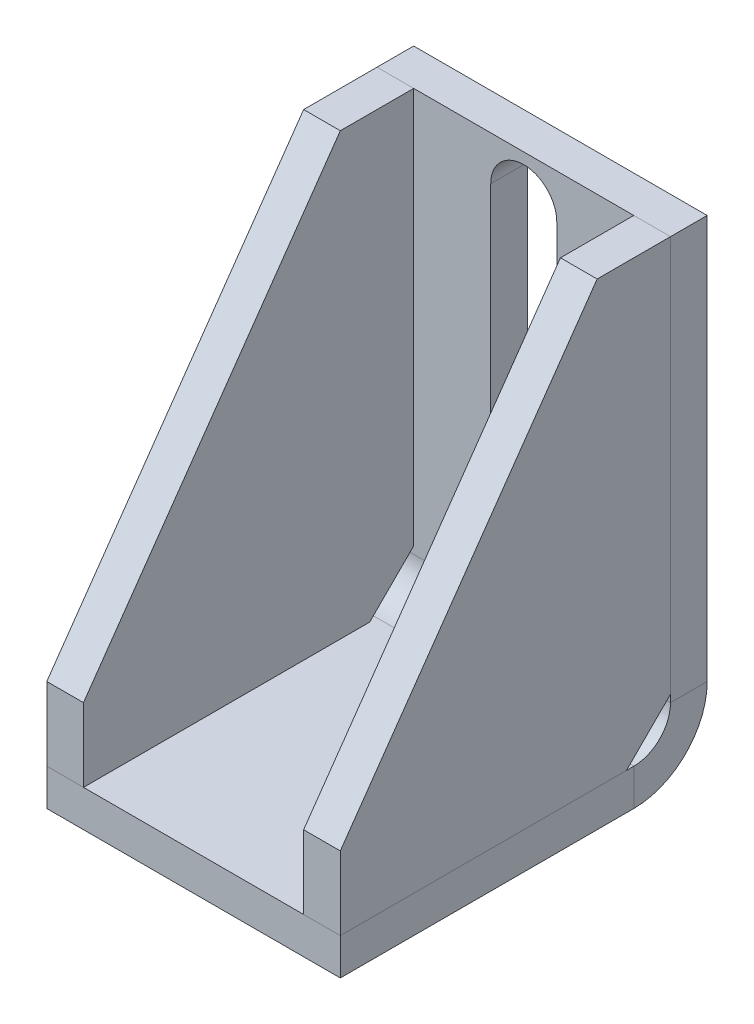
ISO-10303-21;
HEADER;
FILE_DESCRIPTION(('STEP AP214'),'2;1');
FILE_NAME('part.step','',(''),(''),'','','');
FILE_SCHEMA(('AUTOMOTIVE_DESIGN { 1 0 10303 214 1 1 1 1 }'));
ENDSEC;
DATA;
#1=APPLICATION_CONTEXT('core data for automotive mechanical design processes');
#2=APPLICATION_PROTOCOL_DEFINITION('international standard','automotive_design',2000,#1);
#3=PRODUCT_CONTEXT('',#1,'mechanical');
#4=PRODUCT('Part','Part','',(#3));
#5=PRODUCT_RELATED_PRODUCT_CATEGORY('part','',(#4));
#6=PRODUCT_DEFINITION_FORMATION('','',#4);
#7=PRODUCT_DEFINITION_CONTEXT('part definition',#1,'design');
#8=PRODUCT_DEFINITION('design','',#6,#7);
#9=PRODUCT_DEFINITION_SHAPE('','',#8);
#10=(LENGTH_UNIT() NAMED_UNIT(*) SI_UNIT(.MILLI.,.METRE.));
#11=(NAMED_UNIT(*) PLANE_ANGLE_UNIT() SI_UNIT($,.RADIAN.));
#12=(NAMED_UNIT(*) SI_UNIT($,.STERADIAN.) SOLID_ANGLE_UNIT());
#13=UNCERTAINTY_MEASURE_WITH_UNIT(LENGTH_MEASURE(1.E-05),#10,'distance_accuracy_value','');
#14=(GEOMETRIC_REPRESENTATION_CONTEXT(3) GLOBAL_UNCERTAINTY_ASSIGNED_CONTEXT((#13)) GLOBAL_UNIT_ASSIGNED_CONTEXT((#10,
#11,#12)) REPRESENTATION_CONTEXT('',''));
#15=CARTESIAN_POINT('',(0.,0.,0.));
#16=DIRECTION('',(0.,0.,1.));
#17=DIRECTION('',(1.,0.,0.));
#18=AXIS2_PLACEMENT_3D('',#15,#16,#17);
#19=CARTESIAN_POINT('',(15.,20.,10.));
#20=DIRECTION('',(0.,1.,0.));
#21=DIRECTION('',(0.,0.,1.));
#22=AXIS2_PLACEMENT_3D('',#19,#20,#21);
#23=PLANE('',#22);
#24=DIRECTION('',(0.,0.,1.));
#25=VECTOR('',#24,1.);
#26=CARTESIAN_POINT('',(20.,20.,10.));
#27=LINE('',#26,#25);
#28=CARTESIAN_POINT('',(20.,20.,0.));
#29=VERTEX_POINT('',#28);
#30=CARTESIAN_POINT('',(20.,20.,10.));
#31=VERTEX_POINT('',#30);
#32=EDGE_CURVE('E245',#29,#31,#27,.T.);
#33=ORIENTED_EDGE('',*,*,#32,.F.);
#34=DIRECTION('',(1.,0.,0.));
#35=VECTOR('',#34,1.);
#36=CARTESIAN_POINT('',(15.,20.,0.));
#37=LINE('',#36,#35);
#38=CARTESIAN_POINT('',(15.,20.,0.));
#39=VERTEX_POINT('',#38);
#40=EDGE_CURVE('E15',#39,#29,#37,.T.);
#41=ORIENTED_EDGE('',*,*,#40,.F.);
#42=DIRECTION('',(0.,0.,1.));
#43=VECTOR('',#42,1.);
#44=CARTESIAN_POINT('',(15.,20.,10.));
#45=LINE('',#44,#43);
#46=CARTESIAN_POINT('',(15.,20.,10.));
#47=VERTEX_POINT('',#46);
#48=EDGE_CURVE('E265',#39,#47,#45,.T.);
#49=ORIENTED_EDGE('',*,*,#48,.T.);
#50=DIRECTION('',(1.,0.,0.));
#51=VECTOR('',#50,1.);
#52=CARTESIAN_POINT('',(15.,20.,10.));
#53=LINE('',#52,#51);
#54=EDGE_CURVE('E156',#47,#31,#53,.T.);
#55=ORIENTED_EDGE('',*,*,#54,.T.);
#56=EDGE_LOOP('',(#33,#41,#49,#55));
#57=FACE_BOUND('',#56,.T.);
#58=ADVANCED_FACE('F153',(#57),#23,.T.);
#59=CARTESIAN_POINT('',(15.,20.,0.));
#60=DIRECTION('',(0.,0.,-1.));
#61=DIRECTION('',(0.,1.,0.));
#62=AXIS2_PLACEMENT_3D('',#59,#60,#61);
#63=PLANE('',#62);
#64=DIRECTION('',(0.,1.,0.));
#65=VECTOR('',#64,1.);
#66=CARTESIAN_POINT('',(20.,20.,0.));
#67=LINE('',#66,#65);
#68=CARTESIAN_POINT('',(20.,-34.0000000000002,0.));
#69=VERTEX_POINT('',#68);
#70=EDGE_CURVE('E262',#69,#29,#67,.T.);
#71=ORIENTED_EDGE('',*,*,#70,.F.);
#72=DIRECTION('',(1.,0.,0.));
#73=VECTOR('',#72,1.);
#74=CARTESIAN_POINT('',(15.,-34.0000000000002,0.));
#75=LINE('',#74,#73);
#76=CARTESIAN_POINT('',(15.,-34.0000000000002,0.));
#77=VERTEX_POINT('',#76);
#78=EDGE_CURVE('E163',#77,#69,#75,.T.);
#79=ORIENTED_EDGE('',*,*,#78,.F.);
#80=DIRECTION('',(0.,1.,0.));
#81=VECTOR('',#80,1.);
#82=CARTESIAN_POINT('',(15.,20.,0.));
#83=LINE('',#82,#81);
#84=EDGE_CURVE('E230',#77,#39,#83,.T.);
#85=ORIENTED_EDGE('',*,*,#84,.T.);
#86=ORIENTED_EDGE('',*,*,#40,.T.);
#87=EDGE_LOOP('',(#71,#79,#85,#86));
#88=FACE_BOUND('',#87,.T.);
#89=ADVANCED_FACE('F279',(#88),#63,.T.);
#90=CARTESIAN_POINT('',(15.,-34.0000000000002,0.));
#91=DIRECTION('',(0.,-0.707106781186548,-0.707106781186547));
#92=DIRECTION('',(0.,0.707106781186547,-0.707106781186548));
#93=AXIS2_PLACEMENT_3D('',#90,#91,#92);
#94=PLANE('',#93);
#95=DIRECTION('',(0.,0.707106781186547,-0.707106781186548));
#96=VECTOR('',#95,1.);
#97=CARTESIAN_POINT('',(20.,-34.0000000000002,0.));
#98=LINE('',#97,#96);
#99=CARTESIAN_POINT('',(20.,-40.0000000000001,5.99999999999999));
#100=VERTEX_POINT('',#99);
#101=EDGE_CURVE('E216',#100,#69,#98,.T.);
#102=ORIENTED_EDGE('',*,*,#101,.F.);
#103=DIRECTION('',(1.,0.,0.));
#104=VECTOR('',#103,1.);
#105=CARTESIAN_POINT('',(15.,-40.0000000000001,5.99999999999999));
#106=LINE('',#105,#104);
#107=CARTESIAN_POINT('',(15.,-40.0000000000001,5.99999999999999));
#108=VERTEX_POINT('',#107);
#109=EDGE_CURVE('E211',#108,#100,#106,.T.);
#110=ORIENTED_EDGE('',*,*,#109,.F.);
#111=DIRECTION('',(0.,0.707106781186547,-0.707106781186548));
#112=VECTOR('',#111,1.);
#113=CARTESIAN_POINT('',(15.,-34.0000000000002,0.));
#114=LINE('',#113,#112);
#115=EDGE_CURVE('E214',#108,#77,#114,.T.);
#116=ORIENTED_EDGE('',*,*,#115,.T.);
#117=ORIENTED_EDGE('',*,*,#78,.T.);
#118=EDGE_LOOP('',(#102,#110,#116,#117));
#119=FACE_BOUND('',#118,.T.);
#120=ADVANCED_FACE('F213',(#119),#94,.T.);
#121=CARTESIAN_POINT('',(15.,-40.0000000000001,5.99999999999999));
#122=DIRECTION('',(0.,-1.,0.));
#123=DIRECTION('',(0.,0.,-1.));
#124=AXIS2_PLACEMENT_3D('',#121,#122,#123);
#125=PLANE('',#124);
#126=DIRECTION('',(0.,0.,-1.));
#127=VECTOR('',#126,1.);
#128=CARTESIAN_POINT('',(20.,-40.0000000000001,5.99999999999999));
#129=LINE('',#128,#127);
#130=CARTESIAN_POINT('',(20.,-40.0000000000002,45.));
#131=VERTEX_POINT('',#130);
#132=EDGE_CURVE('E257',#131,#100,#129,.T.);
#133=ORIENTED_EDGE('',*,*,#132,.F.);
#134=DIRECTION('',(1.,0.,0.));
#135=VECTOR('',#134,1.);
#136=CARTESIAN_POINT('',(15.,-40.0000000000002,45.));
#137=LINE('',#136,#135);
#138=CARTESIAN_POINT('',(15.,-40.0000000000002,45.));
#139=VERTEX_POINT('',#138);
#140=EDGE_CURVE('E222',#139,#131,#137,.T.);
#141=ORIENTED_EDGE('',*,*,#140,.F.);
#142=DIRECTION('',(0.,0.,-1.));
#143=VECTOR('',#142,1.);
#144=CARTESIAN_POINT('',(15.,-40.0000000000001,5.99999999999999));
#145=LINE('',#144,#143);
#146=EDGE_CURVE('E228',#139,#108,#145,.T.);
#147=ORIENTED_EDGE('',*,*,#146,.T.);
#148=ORIENTED_EDGE('',*,*,#109,.T.);
#149=EDGE_LOOP('',(#133,#141,#147,#148));
#150=FACE_BOUND('',#149,.T.);
#151=ADVANCED_FACE('F233',(#150),#125,.T.);
#152=CARTESIAN_POINT('',(15.,-40.0000000000002,45.));
#153=DIRECTION('',(0.,0.,1.));
#154=DIRECTION('',(1.,0.,0.));
#155=AXIS2_PLACEMENT_3D('',#152,#153,#154);
#156=PLANE('',#155);
#157=DIRECTION('',(0.,-1.,0.));
#158=VECTOR('',#157,1.);
#159=CARTESIAN_POINT('',(20.,-40.0000000000002,45.));
#160=LINE('',#159,#158);
#161=CARTESIAN_POINT('',(20.,-30.0000000000001,45.));
#162=VERTEX_POINT('',#161);
#163=EDGE_CURVE('E253',#162,#131,#160,.T.);
#164=ORIENTED_EDGE('',*,*,#163,.F.);
#165=DIRECTION('',(1.,0.,0.));
#166=VECTOR('',#165,1.);
#167=CARTESIAN_POINT('',(15.,-30.0000000000001,45.));
#168=LINE('',#167,#166);
#169=CARTESIAN_POINT('',(15.,-30.0000000000001,45.));
#170=VERTEX_POINT('',#169);
#171=EDGE_CURVE('E270',#170,#162,#168,.T.);
#172=ORIENTED_EDGE('',*,*,#171,.F.);
#173=DIRECTION('',(0.,-1.,0.));
#174=VECTOR('',#173,1.);
#175=CARTESIAN_POINT('',(15.,-40.0000000000002,45.));
#176=LINE('',#175,#174);
#177=EDGE_CURVE('E235',#170,#139,#176,.T.);
#178=ORIENTED_EDGE('',*,*,#177,.T.);
#179=ORIENTED_EDGE('',*,*,#140,.T.);
#180=EDGE_LOOP('',(#164,#172,#178,#179));
#181=FACE_BOUND('',#180,.T.);
#182=ADVANCED_FACE('F292',(#181),#156,.T.);
#183=CARTESIAN_POINT('',(15.,-30.0000000000001,45.));
#184=DIRECTION('',(0.,0.573462344363327,0.819231920519041));
#185=DIRECTION('',(0.,-0.819231920519041,0.573462344363327));
#186=AXIS2_PLACEMENT_3D('',#183,#184,#185);
#187=PLANE('',#186);
#188=DIRECTION('',(0.,-0.819231920519041,0.573462344363327));
#189=VECTOR('',#188,1.);
#190=CARTESIAN_POINT('',(20.,-30.0000000000001,45.));
#191=LINE('',#190,#189);
#192=EDGE_CURVE('E249',#31,#162,#191,.T.);
#193=ORIENTED_EDGE('',*,*,#192,.F.);
#194=ORIENTED_EDGE('',*,*,#54,.F.);
#195=DIRECTION('',(0.,-0.819231920519041,0.573462344363327));
#196=VECTOR('',#195,1.);
#197=CARTESIAN_POINT('',(15.,-30.0000000000001,45.));
#198=LINE('',#197,#196);
#199=EDGE_CURVE('E239',#47,#170,#198,.T.);
#200=ORIENTED_EDGE('',*,*,#199,.T.);
#201=ORIENTED_EDGE('',*,*,#171,.T.);
#202=EDGE_LOOP('',(#193,#194,#200,#201));
#203=FACE_BOUND('',#202,.T.);
#204=ADVANCED_FACE('F276',(#203),#187,.T.);
#205=CARTESIAN_POINT('',(15.,0.,0.));
#206=DIRECTION('',(-1.,0.,0.));
#207=DIRECTION('',(0.,-1.,0.));
#208=AXIS2_PLACEMENT_3D('',#205,#206,#207);
#209=PLANE('',#208);
#210=ORIENTED_EDGE('',*,*,#48,.F.);
#211=ORIENTED_EDGE('',*,*,#84,.F.);
#212=ORIENTED_EDGE('',*,*,#115,.F.);
#213=ORIENTED_EDGE('',*,*,#146,.F.);
#214=ORIENTED_EDGE('',*,*,#177,.F.);
#215=ORIENTED_EDGE('',*,*,#199,.F.);
#216=EDGE_LOOP('',(#210,#211,#212,#213,#214,#215));
#217=FACE_BOUND('',#216,.T.);
#218=ADVANCED_FACE('F226',(#217),#209,.T.);
#219=CARTESIAN_POINT('',(20.,0.,0.));
#220=DIRECTION('',(-1.,0.,0.));
#221=DIRECTION('',(0.,-1.,0.));
#222=AXIS2_PLACEMENT_3D('',#219,#220,#221);
#223=PLANE('',#222);
#224=ORIENTED_EDGE('',*,*,#32,.T.);
#225=ORIENTED_EDGE('',*,*,#192,.T.);
#226=ORIENTED_EDGE('',*,*,#163,.T.);
#227=ORIENTED_EDGE('',*,*,#132,.T.);
#228=ORIENTED_EDGE('',*,*,#101,.T.);
#229=ORIENTED_EDGE('',*,*,#70,.T.);
#230=EDGE_LOOP('',(#224,#225,#226,#227,#228,#229));
#231=FACE_BOUND('',#230,.T.);
#232=ADVANCED_FACE('F278',(#231),#223,.F.);
#233=CLOSED_SHELL('',(#58,#89,#120,#151,#182,#204,#218,#232));
#234=MANIFOLD_SOLID_BREP('B2',#233);
#235=CARTESIAN_POINT('',(-15.,-34.0000000000002,0.));
#236=DIRECTION('',(0.,0.,-1.));
#237=DIRECTION('',(-1.,0.,0.));
#238=AXIS2_PLACEMENT_3D('',#235,#236,#237);
#239=PLANE('',#238);
#240=DIRECTION('',(0.,-1.,0.));
#241=VECTOR('',#240,1.);
#242=CARTESIAN_POINT('',(-20.,-34.0000000000002,0.));
#243=LINE('',#242,#241);
#244=CARTESIAN_POINT('',(-20.,20.,0.));
#245=VERTEX_POINT('',#244);
#246=CARTESIAN_POINT('',(-20.,-34.0000000000002,0.));
#247=VERTEX_POINT('',#246);
#248=EDGE_CURVE('E481',#245,#247,#243,.T.);
#249=ORIENTED_EDGE('',*,*,#248,.F.);
#250=DIRECTION('',(-1.,0.,0.));
#251=VECTOR('',#250,1.);
#252=CARTESIAN_POINT('',(-15.,20.,0.));
#253=LINE('',#252,#251);
#254=CARTESIAN_POINT('',(-15.,20.,0.));
#255=VERTEX_POINT('',#254);
#256=EDGE_CURVE('E151',#255,#245,#253,.T.);
#257=ORIENTED_EDGE('',*,*,#256,.F.);
#258=DIRECTION('',(0.,-1.,0.));
#259=VECTOR('',#258,1.);
#260=CARTESIAN_POINT('',(-15.,-34.0000000000002,0.));
#261=LINE('',#260,#259);
#262=CARTESIAN_POINT('',(-15.,-34.0000000000002,0.));
#263=VERTEX_POINT('',#262);
#264=EDGE_CURVE('E501',#255,#263,#261,.T.);
#265=ORIENTED_EDGE('',*,*,#264,.T.);
#266=DIRECTION('',(-1.,0.,0.));
#267=VECTOR('',#266,1.);
#268=CARTESIAN_POINT('',(-15.,-34.0000000000002,0.));
#269=LINE('',#268,#267);
#270=EDGE_CURVE('E392',#263,#247,#269,.T.);
#271=ORIENTED_EDGE('',*,*,#270,.T.);
#272=EDGE_LOOP('',(#249,#257,#265,#271));
#273=FACE_BOUND('',#272,.T.);
#274=ADVANCED_FACE('F389',(#273),#239,.T.);
#275=CARTESIAN_POINT('',(-15.,20.,0.));
#276=DIRECTION('',(0.,1.,0.));
#277=DIRECTION('',(-1.,0.,0.));
#278=AXIS2_PLACEMENT_3D('',#275,#276,#277);
#279=PLANE('',#278);
#280=DIRECTION('',(0.,0.,-1.));
#281=VECTOR('',#280,1.);
#282=CARTESIAN_POINT('',(-20.,20.,0.));
#283=LINE('',#282,#281);
#284=CARTESIAN_POINT('',(-20.,20.,10.));
#285=VERTEX_POINT('',#284);
#286=EDGE_CURVE('E498',#285,#245,#283,.T.);
#287=ORIENTED_EDGE('',*,*,#286,.F.);
#288=DIRECTION('',(-1.,0.,0.));
#289=VECTOR('',#288,1.);
#290=CARTESIAN_POINT('',(-15.,20.,10.));
#291=LINE('',#290,#289);
#292=CARTESIAN_POINT('',(-15.,20.,10.));
#293=VERTEX_POINT('',#292);
#294=EDGE_CURVE('E399',#293,#285,#291,.T.);
#295=ORIENTED_EDGE('',*,*,#294,.F.);
#296=DIRECTION('',(0.,0.,-1.));
#297=VECTOR('',#296,1.);
#298=CARTESIAN_POINT('',(-15.,20.,0.));
#299=LINE('',#298,#297);
#300=EDGE_CURVE('E466',#293,#255,#299,.T.);
#301=ORIENTED_EDGE('',*,*,#300,.T.);
#302=ORIENTED_EDGE('',*,*,#256,.T.);
#303=EDGE_LOOP('',(#287,#295,#301,#302));
#304=FACE_BOUND('',#303,.T.);
#305=ADVANCED_FACE('F515',(#304),#279,.T.);
#306=CARTESIAN_POINT('',(-15.,20.,10.));
#307=DIRECTION('',(0.,0.573462344363327,0.819231920519041));
#308=DIRECTION('',(0.,-0.819231920519041,0.573462344363327));
#309=AXIS2_PLACEMENT_3D('',#306,#307,#308);
#310=PLANE('',#309);
#311=DIRECTION('',(0.,0.819231920519041,-0.573462344363327));
#312=VECTOR('',#311,1.);
#313=CARTESIAN_POINT('',(-20.,20.,10.));
#314=LINE('',#313,#312);
#315=CARTESIAN_POINT('',(-20.,-30.0000000000002,45.));
#316=VERTEX_POINT('',#315);
#317=EDGE_CURVE('E452',#316,#285,#314,.T.);
#318=ORIENTED_EDGE('',*,*,#317,.F.);
#319=DIRECTION('',(-1.,0.,0.));
#320=VECTOR('',#319,1.);
#321=CARTESIAN_POINT('',(-15.,-30.0000000000002,45.));
#322=LINE('',#321,#320);
#323=CARTESIAN_POINT('',(-15.,-30.0000000000002,45.));
#324=VERTEX_POINT('',#323);
#325=EDGE_CURVE('E447',#324,#316,#322,.T.);
#326=ORIENTED_EDGE('',*,*,#325,.F.);
#327=DIRECTION('',(0.,0.819231920519041,-0.573462344363327));
#328=VECTOR('',#327,1.);
#329=CARTESIAN_POINT('',(-15.,20.,10.));
#330=LINE('',#329,#328);
#331=EDGE_CURVE('E450',#324,#293,#330,.T.);
#332=ORIENTED_EDGE('',*,*,#331,.T.);
#333=ORIENTED_EDGE('',*,*,#294,.T.);
#334=EDGE_LOOP('',(#318,#326,#332,#333));
#335=FACE_BOUND('',#334,.T.);
#336=ADVANCED_FACE('F449',(#335),#310,.T.);
#337=CARTESIAN_POINT('',(-15.,-30.0000000000002,45.));
#338=DIRECTION('',(0.,0.,1.));
#339=DIRECTION('',(1.,0.,0.));
#340=AXIS2_PLACEMENT_3D('',#337,#338,#339);
#341=PLANE('',#340);
#342=DIRECTION('',(0.,1.,0.));
#343=VECTOR('',#342,1.);
#344=CARTESIAN_POINT('',(-20.,-30.0000000000002,45.));
#345=LINE('',#344,#343);
#346=CARTESIAN_POINT('',(-20.,-40.0000000000002,45.));
#347=VERTEX_POINT('',#346);
#348=EDGE_CURVE('E493',#347,#316,#345,.T.);
#349=ORIENTED_EDGE('',*,*,#348,.F.);
#350=DIRECTION('',(-1.,0.,0.));
#351=VECTOR('',#350,1.);
#352=CARTESIAN_POINT('',(-15.,-40.0000000000002,45.));
#353=LINE('',#352,#351);
#354=CARTESIAN_POINT('',(-15.,-40.0000000000002,45.));
#355=VERTEX_POINT('',#354);
#356=EDGE_CURVE('E458',#355,#347,#353,.T.);
#357=ORIENTED_EDGE('',*,*,#356,.F.);
#358=DIRECTION('',(0.,1.,0.));
#359=VECTOR('',#358,1.);
#360=CARTESIAN_POINT('',(-15.,-30.0000000000002,45.));
#361=LINE('',#360,#359);
#362=EDGE_CURVE('E464',#355,#324,#361,.T.);
#363=ORIENTED_EDGE('',*,*,#362,.T.);
#364=ORIENTED_EDGE('',*,*,#325,.T.);
#365=EDGE_LOOP('',(#349,#357,#363,#364));
#366=FACE_BOUND('',#365,.T.);
#367=ADVANCED_FACE('F469',(#366),#341,.T.);
#368=CARTESIAN_POINT('',(-15.,-40.0000000000002,45.));
#369=DIRECTION('',(0.,-1.,0.));
#370=DIRECTION('',(0.,0.,-1.));
#371=AXIS2_PLACEMENT_3D('',#368,#369,#370);
#372=PLANE('',#371);
#373=DIRECTION('',(0.,0.,1.));
#374=VECTOR('',#373,1.);
#375=CARTESIAN_POINT('',(-20.,-40.0000000000002,45.));
#376=LINE('',#375,#374);
#377=CARTESIAN_POINT('',(-20.,-40.0000000000002,6.));
#378=VERTEX_POINT('',#377);
#379=EDGE_CURVE('E489',#378,#347,#376,.T.);
#380=ORIENTED_EDGE('',*,*,#379,.F.);
#381=DIRECTION('',(-1.,0.,0.));
#382=VECTOR('',#381,1.);
#383=CARTESIAN_POINT('',(-15.,-40.0000000000002,6.));
#384=LINE('',#383,#382);
#385=CARTESIAN_POINT('',(-15.,-40.0000000000002,6.));
#386=VERTEX_POINT('',#385);
#387=EDGE_CURVE('E506',#386,#378,#384,.T.);
#388=ORIENTED_EDGE('',*,*,#387,.F.);
#389=DIRECTION('',(0.,0.,1.));
#390=VECTOR('',#389,1.);
#391=CARTESIAN_POINT('',(-15.,-40.0000000000002,45.));
#392=LINE('',#391,#390);
#393=EDGE_CURVE('E471',#386,#355,#392,.T.);
#394=ORIENTED_EDGE('',*,*,#393,.T.);
#395=ORIENTED_EDGE('',*,*,#356,.T.);
#396=EDGE_LOOP('',(#380,#388,#394,#395));
#397=FACE_BOUND('',#396,.T.);
#398=ADVANCED_FACE('F528',(#397),#372,.T.);
#399=CARTESIAN_POINT('',(-15.,-40.0000000000002,6.));
#400=DIRECTION('',(0.,-0.707106781186548,-0.707106781186547));
#401=DIRECTION('',(0.,0.707106781186547,-0.707106781186548));
#402=AXIS2_PLACEMENT_3D('',#399,#400,#401);
#403=PLANE('',#402);
#404=DIRECTION('',(0.,-0.707106781186547,0.707106781186548));
#405=VECTOR('',#404,1.);
#406=CARTESIAN_POINT('',(-20.,-40.0000000000002,6.));
#407=LINE('',#406,#405);
#408=EDGE_CURVE('E485',#247,#378,#407,.T.);
#409=ORIENTED_EDGE('',*,*,#408,.F.);
#410=ORIENTED_EDGE('',*,*,#270,.F.);
#411=DIRECTION('',(0.,-0.707106781186547,0.707106781186548));
#412=VECTOR('',#411,1.);
#413=CARTESIAN_POINT('',(-15.,-40.0000000000002,6.));
#414=LINE('',#413,#412);
#415=EDGE_CURVE('E475',#263,#386,#414,.T.);
#416=ORIENTED_EDGE('',*,*,#415,.T.);
#417=ORIENTED_EDGE('',*,*,#387,.T.);
#418=EDGE_LOOP('',(#409,#410,#416,#417));
#419=FACE_BOUND('',#418,.T.);
#420=ADVANCED_FACE('F512',(#419),#403,.T.);
#421=CARTESIAN_POINT('',(-15.,0.,0.));
#422=DIRECTION('',(1.,0.,0.));
#423=DIRECTION('',(0.,1.,0.));
#424=AXIS2_PLACEMENT_3D('',#421,#422,#423);
#425=PLANE('',#424);
#426=ORIENTED_EDGE('',*,*,#264,.F.);
#427=ORIENTED_EDGE('',*,*,#300,.F.);
#428=ORIENTED_EDGE('',*,*,#331,.F.);
#429=ORIENTED_EDGE('',*,*,#362,.F.);
#430=ORIENTED_EDGE('',*,*,#393,.F.);
#431=ORIENTED_EDGE('',*,*,#415,.F.);
#432=EDGE_LOOP('',(#426,#427,#428,#429,#430,#431));
#433=FACE_BOUND('',#432,.T.);
#434=ADVANCED_FACE('F462',(#433),#425,.T.);
#435=CARTESIAN_POINT('',(-20.,0.,0.));
#436=DIRECTION('',(1.,0.,0.));
#437=DIRECTION('',(0.,1.,0.));
#438=AXIS2_PLACEMENT_3D('',#435,#436,#437);
#439=PLANE('',#438);
#440=ORIENTED_EDGE('',*,*,#248,.T.);
#441=ORIENTED_EDGE('',*,*,#408,.T.);
#442=ORIENTED_EDGE('',*,*,#379,.T.);
#443=ORIENTED_EDGE('',*,*,#348,.T.);
#444=ORIENTED_EDGE('',*,*,#317,.T.);
#445=ORIENTED_EDGE('',*,*,#286,.T.);
#446=EDGE_LOOP('',(#440,#441,#442,#443,#444,#445));
#447=FACE_BOUND('',#446,.T.);
#448=ADVANCED_FACE('F514',(#447),#439,.F.);
#449=CLOSED_SHELL('',(#274,#305,#336,#367,#398,#420,#434,#448));
#450=MANIFOLD_SOLID_BREP('B9',#449);
#451=CARTESIAN_POINT('',(20.,20.,-5.));
#452=DIRECTION('',(1.,0.,0.));
#453=DIRECTION('',(0.,1.,0.));
#454=AXIS2_PLACEMENT_3D('',#451,#452,#453);
#455=PLANE('',#454);
#456=DIRECTION('',(0.,1.,0.));
#457=VECTOR('',#456,1.);
#458=CARTESIAN_POINT('',(20.,20.,0.));
#459=LINE('',#458,#457);
#460=CARTESIAN_POINT('',(20.,-35.,0.));
#461=VERTEX_POINT('',#460);
#462=CARTESIAN_POINT('',(20.,20.,0.));
#463=VERTEX_POINT('',#462);
#464=EDGE_CURVE('E845',#461,#463,#459,.T.);
#465=ORIENTED_EDGE('',*,*,#464,.F.);
#466=DIRECTION('',(0.,0.,-1.));
#467=VECTOR('',#466,1.);
#468=CARTESIAN_POINT('',(20.,-35.,0.));
#469=LINE('',#468,#467);
#470=CARTESIAN_POINT('',(20.,-35.,-5.));
#471=VERTEX_POINT('',#470);
#472=EDGE_CURVE('E807',#461,#471,#469,.T.);
#473=ORIENTED_EDGE('',*,*,#472,.T.);
#474=DIRECTION('',(0.,1.,0.));
#475=VECTOR('',#474,1.);
#476=CARTESIAN_POINT('',(20.,20.,-5.));
#477=LINE('',#476,#475);
#478=CARTESIAN_POINT('',(20.,20.,-5.));
#479=VERTEX_POINT('',#478);
#480=EDGE_CURVE('E834',#471,#479,#477,.T.);
#481=ORIENTED_EDGE('',*,*,#480,.T.);
#482=DIRECTION('',(0.,0.,1.));
#483=VECTOR('',#482,1.);
#484=CARTESIAN_POINT('',(20.,20.,-5.));
#485=LINE('',#484,#483);
#486=EDGE_CURVE('E620',#479,#463,#485,.T.);
#487=ORIENTED_EDGE('',*,*,#486,.T.);
#488=EDGE_LOOP('',(#465,#473,#481,#487));
#489=FACE_BOUND('',#488,.T.);
#490=ADVANCED_FACE('F616',(#489),#455,.T.);
#491=CARTESIAN_POINT('',(0.,0.,-5.));
#492=DIRECTION('',(0.,0.,1.));
#493=DIRECTION('',(1.,0.,0.));
#494=AXIS2_PLACEMENT_3D('',#491,#492,#493);
#495=PLANE('',#494);
#496=DIRECTION('',(0.,-1.,0.));
#497=VECTOR('',#496,1.);
#498=CARTESIAN_POINT('',(-4.5,0.,-5.));
#499=LINE('',#498,#497);
#500=CARTESIAN_POINT('',(-4.5,14.,-5.));
#501=VERTEX_POINT('',#500);
#502=CARTESIAN_POINT('',(-4.5,-13.05,-5.));
#503=VERTEX_POINT('',#502);
#504=EDGE_CURVE('E743',#501,#503,#499,.T.);
#505=ORIENTED_EDGE('',*,*,#504,.T.);
#506=CARTESIAN_POINT('',(0.,-13.05,-5.));
#507=DIRECTION('',(0.,0.,1.));
#508=DIRECTION('',(1.,0.,0.));
#509=AXIS2_PLACEMENT_3D('',#506,#507,#508);
#510=CIRCLE('',#509,4.5);
#511=CARTESIAN_POINT('',(4.5,-13.05,-5.));
#512=VERTEX_POINT('',#511);
#513=EDGE_CURVE('E753',#503,#512,#510,.T.);
#514=ORIENTED_EDGE('',*,*,#513,.T.);
#515=DIRECTION('',(0.,-1.,0.));
#516=VECTOR('',#515,1.);
#517=CARTESIAN_POINT('',(4.5,0.,-5.));
#518=LINE('',#517,#516);
#519=CARTESIAN_POINT('',(4.5,14.,-5.));
#520=VERTEX_POINT('',#519);
#521=EDGE_CURVE('E722',#520,#512,#518,.T.);
#522=ORIENTED_EDGE('',*,*,#521,.F.);
#523=CARTESIAN_POINT('',(0.,14.,-5.));
#524=DIRECTION('',(0.,0.,1.));
#525=DIRECTION('',(1.,0.,0.));
#526=AXIS2_PLACEMENT_3D('',#523,#524,#525);
#527=CIRCLE('',#526,4.5);
#528=EDGE_CURVE('E747',#520,#501,#527,.T.);
#529=ORIENTED_EDGE('',*,*,#528,.T.);
#530=EDGE_LOOP('',(#505,#514,#522,#529));
#531=FACE_BOUND('',#530,.T.);
#532=DIRECTION('',(1.,0.,0.));
#533=VECTOR('',#532,1.);
#534=CARTESIAN_POINT('',(20.,-35.,-5.));
#535=LINE('',#534,#533);
#536=CARTESIAN_POINT('',(-20.,-35.,-5.));
#537=VERTEX_POINT('',#536);
#538=EDGE_CURVE('E799',#471,#537,#535,.F.);
#539=ORIENTED_EDGE('',*,*,#538,.T.);
#540=DIRECTION('',(0.,-1.,0.));
#541=VECTOR('',#540,1.);
#542=CARTESIAN_POINT('',(-20.,20.,-5.));
#543=LINE('',#542,#541);
#544=CARTESIAN_POINT('',(-20.,20.,-5.));
#545=VERTEX_POINT('',#544);
#546=EDGE_CURVE('E830',#545,#537,#543,.T.);
#547=ORIENTED_EDGE('',*,*,#546,.F.);
#548=DIRECTION('',(-1.,0.,0.));
#549=VECTOR('',#548,1.);
#550=CARTESIAN_POINT('',(-20.,20.,-5.));
#551=LINE('',#550,#549);
#552=EDGE_CURVE('E838',#479,#545,#551,.T.);
#553=ORIENTED_EDGE('',*,*,#552,.F.);
#554=ORIENTED_EDGE('',*,*,#480,.F.);
#555=EDGE_LOOP('',(#539,#547,#553,#554));
#556=FACE_BOUND('',#555,.T.);
#557=ADVANCED_FACE('F902',(#531,#556),#495,.F.);
#558=CARTESIAN_POINT('',(0.,0.,0.));
#559=DIRECTION('',(0.,0.,1.));
#560=DIRECTION('',(1.,0.,0.));
#561=AXIS2_PLACEMENT_3D('',#558,#559,#560);
#562=PLANE('',#561);
#563=CARTESIAN_POINT('',(0.,-13.05,0.));
#564=DIRECTION('',(0.,0.,1.));
#565=DIRECTION('',(1.,0.,0.));
#566=AXIS2_PLACEMENT_3D('',#563,#564,#565);
#567=CIRCLE('',#566,4.5);
#568=CARTESIAN_POINT('',(-4.49999999999998,-13.05,0.));
#569=VERTEX_POINT('',#568);
#570=CARTESIAN_POINT('',(4.5,-13.05,0.));
#571=VERTEX_POINT('',#570);
#572=EDGE_CURVE('E705',#569,#571,#567,.T.);
#573=ORIENTED_EDGE('',*,*,#572,.F.);
#574=DIRECTION('',(0.,-1.,0.));
#575=VECTOR('',#574,1.);
#576=CARTESIAN_POINT('',(-4.49999999999998,14.,0.));
#577=LINE('',#576,#575);
#578=CARTESIAN_POINT('',(-4.5,14.,0.));
#579=VERTEX_POINT('',#578);
#580=EDGE_CURVE('E729',#579,#569,#577,.T.);
#581=ORIENTED_EDGE('',*,*,#580,.F.);
#582=CARTESIAN_POINT('',(0.,14.,0.));
#583=DIRECTION('',(0.,0.,1.));
#584=DIRECTION('',(1.,0.,0.));
#585=AXIS2_PLACEMENT_3D('',#582,#583,#584);
#586=CIRCLE('',#585,4.5);
#587=CARTESIAN_POINT('',(4.5,14.,0.));
#588=VERTEX_POINT('',#587);
#589=EDGE_CURVE('E727',#588,#579,#586,.T.);
#590=ORIENTED_EDGE('',*,*,#589,.F.);
#591=DIRECTION('',(0.,-1.,0.));
#592=VECTOR('',#591,1.);
#593=CARTESIAN_POINT('',(4.5,14.,0.));
#594=LINE('',#593,#592);
#595=EDGE_CURVE('E719',#588,#571,#594,.T.);
#596=ORIENTED_EDGE('',*,*,#595,.T.);
#597=EDGE_LOOP('',(#573,#581,#590,#596));
#598=FACE_BOUND('',#597,.T.);
#599=DIRECTION('',(0.,-1.,0.));
#600=VECTOR('',#599,1.);
#601=CARTESIAN_POINT('',(-20.,20.,0.));
#602=LINE('',#601,#600);
#603=CARTESIAN_POINT('',(-20.,20.,0.));
#604=VERTEX_POINT('',#603);
#605=CARTESIAN_POINT('',(-20.,-35.,0.));
#606=VERTEX_POINT('',#605);
#607=EDGE_CURVE('E826',#604,#606,#602,.T.);
#608=ORIENTED_EDGE('',*,*,#607,.T.);
#609=DIRECTION('',(1.,0.,0.));
#610=VECTOR('',#609,1.);
#611=CARTESIAN_POINT('',(20.,-35.,0.));
#612=LINE('',#611,#610);
#613=EDGE_CURVE('E815',#461,#606,#612,.F.);
#614=ORIENTED_EDGE('',*,*,#613,.F.);
#615=ORIENTED_EDGE('',*,*,#464,.T.);
#616=DIRECTION('',(-1.,0.,0.));
#617=VECTOR('',#616,1.);
#618=CARTESIAN_POINT('',(-20.,20.,0.));
#619=LINE('',#618,#617);
#620=EDGE_CURVE('E835',#463,#604,#619,.T.);
#621=ORIENTED_EDGE('',*,*,#620,.T.);
#622=EDGE_LOOP('',(#608,#614,#615,#621));
#623=FACE_BOUND('',#622,.T.);
#624=ADVANCED_FACE('F725',(#598,#623),#562,.T.);
#625=CARTESIAN_POINT('',(-20.,20.,-5.));
#626=DIRECTION('',(-1.,0.,0.));
#627=DIRECTION('',(0.,-1.,0.));
#628=AXIS2_PLACEMENT_3D('',#625,#626,#627);
#629=PLANE('',#628);
#630=DIRECTION('',(0.,0.,-1.));
#631=VECTOR('',#630,1.);
#632=CARTESIAN_POINT('',(-20.,-35.,0.));
#633=LINE('',#632,#631);
#634=EDGE_CURVE('E822',#606,#537,#633,.T.);
#635=ORIENTED_EDGE('',*,*,#634,.F.);
#636=ORIENTED_EDGE('',*,*,#607,.F.);
#637=DIRECTION('',(0.,0.,1.));
#638=VECTOR('',#637,1.);
#639=CARTESIAN_POINT('',(-20.,20.,-5.));
#640=LINE('',#639,#638);
#641=EDGE_CURVE('E387',#545,#604,#640,.T.);
#642=ORIENTED_EDGE('',*,*,#641,.F.);
#643=ORIENTED_EDGE('',*,*,#546,.T.);
#644=EDGE_LOOP('',(#635,#636,#642,#643));
#645=FACE_BOUND('',#644,.T.);
#646=ADVANCED_FACE('F618',(#645),#629,.T.);
#647=CARTESIAN_POINT('',(-20.,20.,-5.));
#648=DIRECTION('',(0.,1.,0.));
#649=DIRECTION('',(-1.,0.,0.));
#650=AXIS2_PLACEMENT_3D('',#647,#648,#649);
#651=PLANE('',#650);
#652=ORIENTED_EDGE('',*,*,#620,.F.);
#653=ORIENTED_EDGE('',*,*,#486,.F.);
#654=ORIENTED_EDGE('',*,*,#552,.T.);
#655=ORIENTED_EDGE('',*,*,#641,.T.);
#656=EDGE_LOOP('',(#652,#653,#654,#655));
#657=FACE_BOUND('',#656,.T.);
#658=ADVANCED_FACE('F857',(#657),#651,.T.);
#659=CARTESIAN_POINT('',(-20.,-35.,5.));
#660=DIRECTION('',(-1.,0.,0.));
#661=DIRECTION('',(0.,0.,1.));
#662=AXIS2_PLACEMENT_3D('',#659,#660,#661);
#663=PLANE('',#662);
#664=DIRECTION('',(0.,1.,0.));
#665=VECTOR('',#664,1.);
#666=CARTESIAN_POINT('',(-20.,-45.,4.99999999999997));
#667=LINE('',#666,#665);
#668=CARTESIAN_POINT('',(-20.,-40.,4.99999999999998));
#669=VERTEX_POINT('',#668);
#670=CARTESIAN_POINT('',(-20.,-45.,4.99999999999997));
#671=VERTEX_POINT('',#670);
#672=EDGE_CURVE('E756',#669,#671,#667,.F.);
#673=ORIENTED_EDGE('',*,*,#672,.F.);
#674=CARTESIAN_POINT('',(-20.,-35.,5.));
#675=DIRECTION('',(1.,0.,0.));
#676=DIRECTION('',(0.,0.,-1.));
#677=AXIS2_PLACEMENT_3D('',#674,#675,#676);
#678=CIRCLE('',#677,5.);
#679=EDGE_CURVE('E811',#606,#669,#678,.F.);
#680=ORIENTED_EDGE('',*,*,#679,.F.);
#681=ORIENTED_EDGE('',*,*,#634,.T.);
#682=CARTESIAN_POINT('',(-20.,-35.,5.));
#683=DIRECTION('',(1.,0.,0.));
#684=DIRECTION('',(0.,0.,-1.));
#685=AXIS2_PLACEMENT_3D('',#682,#683,#684);
#686=CIRCLE('',#685,10.);
#687=EDGE_CURVE('E802',#537,#671,#686,.F.);
#688=ORIENTED_EDGE('',*,*,#687,.T.);
#689=EDGE_LOOP('',(#673,#680,#681,#688));
#690=FACE_BOUND('',#689,.T.);
#691=ADVANCED_FACE('F864',(#690),#663,.T.);
#692=CARTESIAN_POINT('',(20.,-35.,5.));
#693=DIRECTION('',(-1.,0.,0.));
#694=DIRECTION('',(0.,0.,1.));
#695=AXIS2_PLACEMENT_3D('',#692,#693,#694);
#696=PLANE('',#695);
#697=CARTESIAN_POINT('',(20.,-35.,5.));
#698=DIRECTION('',(1.,0.,0.));
#699=DIRECTION('',(0.,0.,-1.));
#700=AXIS2_PLACEMENT_3D('',#697,#698,#699);
#701=CIRCLE('',#700,5.);
#702=CARTESIAN_POINT('',(20.,-40.,4.99999999999998));
#703=VERTEX_POINT('',#702);
#704=EDGE_CURVE('E761',#703,#461,#701,.T.);
#705=ORIENTED_EDGE('',*,*,#704,.F.);
#706=DIRECTION('',(0.,1.,0.));
#707=VECTOR('',#706,1.);
#708=CARTESIAN_POINT('',(20.,-40.,4.99999999999998));
#709=LINE('',#708,#707);
#710=CARTESIAN_POINT('',(20.,-45.,4.99999999999997));
#711=VERTEX_POINT('',#710);
#712=EDGE_CURVE('E789',#703,#711,#709,.F.);
#713=ORIENTED_EDGE('',*,*,#712,.T.);
#714=CARTESIAN_POINT('',(20.,-35.,5.));
#715=DIRECTION('',(1.,0.,0.));
#716=DIRECTION('',(0.,0.,-1.));
#717=AXIS2_PLACEMENT_3D('',#714,#715,#716);
#718=CIRCLE('',#717,10.);
#719=EDGE_CURVE('E803',#711,#471,#718,.T.);
#720=ORIENTED_EDGE('',*,*,#719,.T.);
#721=ORIENTED_EDGE('',*,*,#472,.F.);
#722=EDGE_LOOP('',(#705,#713,#720,#721));
#723=FACE_BOUND('',#722,.T.);
#724=ADVANCED_FACE('F914',(#723),#696,.F.);
#725=CARTESIAN_POINT('',(20.,-35.,5.));
#726=DIRECTION('',(1.,0.,0.));
#727=DIRECTION('',(0.,-1.,0.));
#728=AXIS2_PLACEMENT_3D('',#725,#726,#727);
#729=CYLINDRICAL_SURFACE('',#728,10.);
#730=ORIENTED_EDGE('',*,*,#538,.F.);
#731=ORIENTED_EDGE('',*,*,#719,.F.);
#732=DIRECTION('',(1.,0.,0.));
#733=VECTOR('',#732,1.);
#734=CARTESIAN_POINT('',(-20.,-45.,4.99999999999997));
#735=LINE('',#734,#733);
#736=EDGE_CURVE('E786',#711,#671,#735,.F.);
#737=ORIENTED_EDGE('',*,*,#736,.T.);
#738=ORIENTED_EDGE('',*,*,#687,.F.);
#739=EDGE_LOOP('',(#730,#731,#737,#738));
#740=FACE_BOUND('',#739,.T.);
#741=ADVANCED_FACE('F867',(#740),#729,.T.);
#742=CARTESIAN_POINT('',(20.,-35.,5.));
#743=DIRECTION('',(1.,0.,0.));
#744=DIRECTION('',(0.,-1.,0.));
#745=AXIS2_PLACEMENT_3D('',#742,#743,#744);
#746=CYLINDRICAL_SURFACE('',#745,5.);
#747=ORIENTED_EDGE('',*,*,#613,.T.);
#748=ORIENTED_EDGE('',*,*,#679,.T.);
#749=DIRECTION('',(1.,0.,0.));
#750=VECTOR('',#749,1.);
#751=CARTESIAN_POINT('',(-20.,-40.,4.99999999999998));
#752=LINE('',#751,#750);
#753=EDGE_CURVE('E793',#669,#703,#752,.T.);
#754=ORIENTED_EDGE('',*,*,#753,.T.);
#755=ORIENTED_EDGE('',*,*,#704,.T.);
#756=EDGE_LOOP('',(#747,#748,#754,#755));
#757=FACE_BOUND('',#756,.T.);
#758=ADVANCED_FACE('F888',(#757),#746,.F.);
#759=CARTESIAN_POINT('',(20.,-45.0000000000001,45.));
#760=DIRECTION('',(-1.,0.,0.));
#761=DIRECTION('',(0.,-1.,0.));
#762=AXIS2_PLACEMENT_3D('',#759,#760,#761);
#763=PLANE('',#762);
#764=ORIENTED_EDGE('',*,*,#712,.F.);
#765=DIRECTION('',(0.,0.,-1.));
#766=VECTOR('',#765,1.);
#767=CARTESIAN_POINT('',(20.,-40.0000000000002,45.));
#768=LINE('',#767,#766);
#769=CARTESIAN_POINT('',(20.,-40.0000000000002,45.));
#770=VERTEX_POINT('',#769);
#771=EDGE_CURVE('E783',#703,#770,#768,.F.);
#772=ORIENTED_EDGE('',*,*,#771,.T.);
#773=DIRECTION('',(0.,1.,0.));
#774=VECTOR('',#773,1.);
#775=CARTESIAN_POINT('',(20.,-45.0000000000001,45.));
#776=LINE('',#775,#774);
#777=CARTESIAN_POINT('',(20.,-45.0000000000001,45.));
#778=VERTEX_POINT('',#777);
#779=EDGE_CURVE('E757',#778,#770,#776,.T.);
#780=ORIENTED_EDGE('',*,*,#779,.F.);
#781=DIRECTION('',(0.,0.,1.));
#782=VECTOR('',#781,1.);
#783=CARTESIAN_POINT('',(20.,-45.,-1.70113072580175E-13));
#784=LINE('',#783,#782);
#785=EDGE_CURVE('E773',#711,#778,#784,.T.);
#786=ORIENTED_EDGE('',*,*,#785,.F.);
#787=EDGE_LOOP('',(#764,#772,#780,#786));
#788=FACE_BOUND('',#787,.T.);
#789=ADVANCED_FACE('F876',(#788),#763,.F.);
#790=CARTESIAN_POINT('',(-20.,-45.,0.));
#791=DIRECTION('',(1.,0.,0.));
#792=DIRECTION('',(0.,1.,0.));
#793=AXIS2_PLACEMENT_3D('',#790,#791,#792);
#794=PLANE('',#793);
#795=ORIENTED_EDGE('',*,*,#672,.T.);
#796=DIRECTION('',(0.,0.,-1.));
#797=VECTOR('',#796,1.);
#798=CARTESIAN_POINT('',(-20.,-45.,-1.70113072580175E-13));
#799=LINE('',#798,#797);
#800=CARTESIAN_POINT('',(-20.,-45.0000000000001,45.));
#801=VERTEX_POINT('',#800);
#802=EDGE_CURVE('E766',#801,#671,#799,.T.);
#803=ORIENTED_EDGE('',*,*,#802,.F.);
#804=DIRECTION('',(0.,1.,0.));
#805=VECTOR('',#804,1.);
#806=CARTESIAN_POINT('',(-20.,-45.0000000000002,45.));
#807=LINE('',#806,#805);
#808=CARTESIAN_POINT('',(-20.,-40.0000000000002,45.));
#809=VERTEX_POINT('',#808);
#810=EDGE_CURVE('E762',#801,#809,#807,.T.);
#811=ORIENTED_EDGE('',*,*,#810,.T.);
#812=DIRECTION('',(0.,0.,1.));
#813=VECTOR('',#812,1.);
#814=CARTESIAN_POINT('',(-20.,-40.,0.));
#815=LINE('',#814,#813);
#816=EDGE_CURVE('E776',#809,#669,#815,.F.);
#817=ORIENTED_EDGE('',*,*,#816,.T.);
#818=EDGE_LOOP('',(#795,#803,#811,#817));
#819=FACE_BOUND('',#818,.T.);
#820=ADVANCED_FACE('F885',(#819),#794,.F.);
#821=CARTESIAN_POINT('',(0.,-45.,-1.70113072580175E-13));
#822=DIRECTION('',(0.,1.,0.));
#823=DIRECTION('',(0.,0.,1.));
#824=AXIS2_PLACEMENT_3D('',#821,#822,#823);
#825=PLANE('',#824);
#826=ORIENTED_EDGE('',*,*,#736,.F.);
#827=ORIENTED_EDGE('',*,*,#785,.T.);
#828=DIRECTION('',(-1.,0.,0.));
#829=VECTOR('',#828,1.);
#830=CARTESIAN_POINT('',(0.,-45.0000000000001,45.));
#831=LINE('',#830,#829);
#832=EDGE_CURVE('E770',#778,#801,#831,.T.);
#833=ORIENTED_EDGE('',*,*,#832,.T.);
#834=ORIENTED_EDGE('',*,*,#802,.T.);
#835=EDGE_LOOP('',(#826,#827,#833,#834));
#836=FACE_BOUND('',#835,.T.);
#837=ADVANCED_FACE('F871',(#836),#825,.F.);
#838=CARTESIAN_POINT('',(0.,-40.,-1.52655665885959E-13));
#839=DIRECTION('',(0.,1.,0.));
#840=DIRECTION('',(0.,0.,1.));
#841=AXIS2_PLACEMENT_3D('',#838,#839,#840);
#842=PLANE('',#841);
#843=ORIENTED_EDGE('',*,*,#771,.F.);
#844=ORIENTED_EDGE('',*,*,#753,.F.);
#845=ORIENTED_EDGE('',*,*,#816,.F.);
#846=DIRECTION('',(1.,0.,0.));
#847=VECTOR('',#846,1.);
#848=CARTESIAN_POINT('',(-20.,-40.0000000000002,45.));
#849=LINE('',#848,#847);
#850=EDGE_CURVE('E780',#770,#809,#849,.F.);
#851=ORIENTED_EDGE('',*,*,#850,.F.);
#852=EDGE_LOOP('',(#843,#844,#845,#851));
#853=FACE_BOUND('',#852,.T.);
#854=ADVANCED_FACE('F891',(#853),#842,.T.);
#855=CARTESIAN_POINT('',(-20.,-45.0000000000002,45.));
#856=DIRECTION('',(0.,0.,-1.));
#857=DIRECTION('',(0.,1.,0.));
#858=AXIS2_PLACEMENT_3D('',#855,#856,#857);
#859=PLANE('',#858);
#860=ORIENTED_EDGE('',*,*,#850,.T.);
#861=ORIENTED_EDGE('',*,*,#810,.F.);
#862=ORIENTED_EDGE('',*,*,#832,.F.);
#863=ORIENTED_EDGE('',*,*,#779,.T.);
#864=EDGE_LOOP('',(#860,#861,#862,#863));
#865=FACE_BOUND('',#864,.T.);
#866=ADVANCED_FACE('F882',(#865),#859,.F.);
#867=CARTESIAN_POINT('',(0.,-13.05,0.));
#868=DIRECTION('',(0.,0.,1.));
#869=DIRECTION('',(1.,0.,0.));
#870=AXIS2_PLACEMENT_3D('',#867,#868,#869);
#871=CYLINDRICAL_SURFACE('',#870,4.5);
#872=DIRECTION('',(0.,0.,1.));
#873=VECTOR('',#872,1.);
#874=CARTESIAN_POINT('',(-4.5,-13.05,0.));
#875=LINE('',#874,#873);
#876=EDGE_CURVE('E711',#569,#503,#875,.F.);
#877=ORIENTED_EDGE('',*,*,#876,.F.);
#878=ORIENTED_EDGE('',*,*,#572,.T.);
#879=DIRECTION('',(0.,0.,-1.));
#880=VECTOR('',#879,1.);
#881=CARTESIAN_POINT('',(4.5,-13.05,-15.));
#882=LINE('',#881,#880);
#883=EDGE_CURVE('E708',#571,#512,#882,.T.);
#884=ORIENTED_EDGE('',*,*,#883,.T.);
#885=ORIENTED_EDGE('',*,*,#513,.F.);
#886=EDGE_LOOP('',(#877,#878,#884,#885));
#887=FACE_BOUND('',#886,.T.);
#888=ADVANCED_FACE('F707',(#887),#871,.F.);
#889=CARTESIAN_POINT('',(4.5,14.,-15.));
#890=DIRECTION('',(-1.,0.,0.));
#891=DIRECTION('',(0.,0.,1.));
#892=AXIS2_PLACEMENT_3D('',#889,#890,#891);
#893=PLANE('',#892);
#894=ORIENTED_EDGE('',*,*,#521,.T.);
#895=ORIENTED_EDGE('',*,*,#883,.F.);
#896=ORIENTED_EDGE('',*,*,#595,.F.);
#897=DIRECTION('',(0.,0.,-1.));
#898=VECTOR('',#897,1.);
#899=CARTESIAN_POINT('',(4.5,14.,-15.));
#900=LINE('',#899,#898);
#901=EDGE_CURVE('E637',#588,#520,#900,.T.);
#902=ORIENTED_EDGE('',*,*,#901,.T.);
#903=EDGE_LOOP('',(#894,#895,#896,#902));
#904=FACE_BOUND('',#903,.T.);
#905=ADVANCED_FACE('F718',(#904),#893,.T.);
#906=CARTESIAN_POINT('',(0.,14.,0.));
#907=DIRECTION('',(0.,0.,1.));
#908=DIRECTION('',(1.,0.,0.));
#909=AXIS2_PLACEMENT_3D('',#906,#907,#908);
#910=CYLINDRICAL_SURFACE('',#909,4.5);
#911=ORIENTED_EDGE('',*,*,#901,.F.);
#912=ORIENTED_EDGE('',*,*,#589,.T.);
#913=DIRECTION('',(0.,0.,1.));
#914=VECTOR('',#913,1.);
#915=CARTESIAN_POINT('',(-4.5,14.,0.));
#916=LINE('',#915,#914);
#917=EDGE_CURVE('E632',#501,#579,#916,.T.);
#918=ORIENTED_EDGE('',*,*,#917,.F.);
#919=ORIENTED_EDGE('',*,*,#528,.F.);
#920=EDGE_LOOP('',(#911,#912,#918,#919));
#921=FACE_BOUND('',#920,.T.);
#922=ADVANCED_FACE('F963',(#921),#910,.F.);
#923=CARTESIAN_POINT('',(-4.5,14.,0.));
#924=DIRECTION('',(-1.,0.,0.));
#925=DIRECTION('',(0.,-1.,0.));
#926=AXIS2_PLACEMENT_3D('',#923,#924,#925);
#927=PLANE('',#926);
#928=ORIENTED_EDGE('',*,*,#917,.T.);
#929=ORIENTED_EDGE('',*,*,#580,.T.);
#930=ORIENTED_EDGE('',*,*,#876,.T.);
#931=ORIENTED_EDGE('',*,*,#504,.F.);
#932=EDGE_LOOP('',(#928,#929,#930,#931));
#933=FACE_BOUND('',#932,.T.);
#934=ADVANCED_FACE('F972',(#933),#927,.F.);
#935=CLOSED_SHELL('',(#490,#557,#624,#646,#658,#691,#724,#741,#758,#789,#820,#837,#854,#866,
#888,#905,#922,#934));
#936=MANIFOLD_SOLID_BREP('B145',#935);
#937=ADVANCED_BREP_SHAPE_REPRESENTATION('',(#18,#234,#450,#936),#14);
#938=SHAPE_DEFINITION_REPRESENTATION(#9,#937);
ENDSEC;
END-ISO-10303-21;
